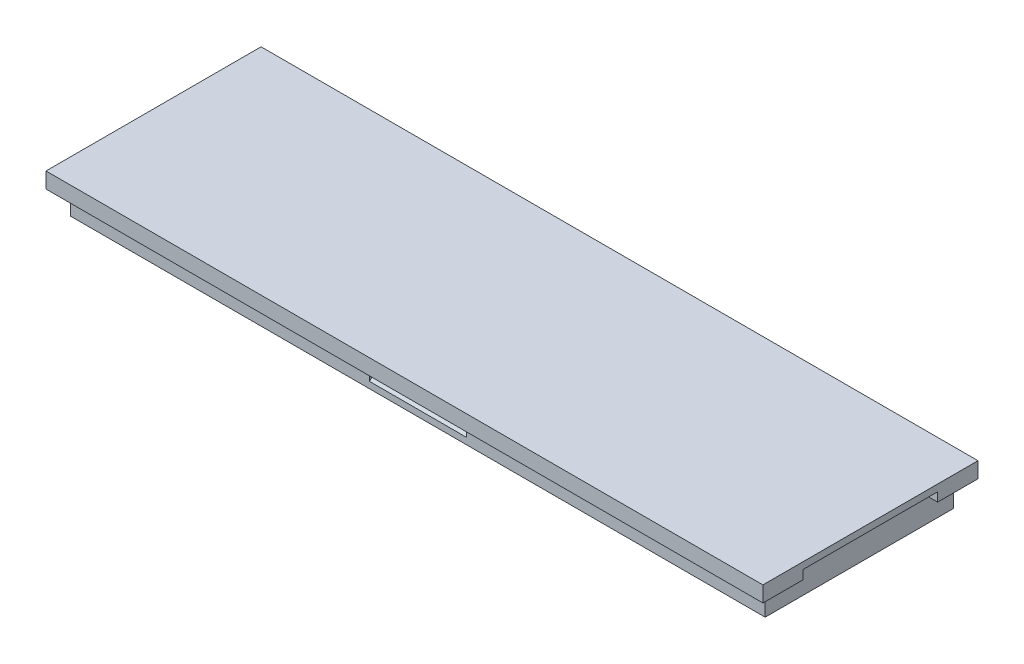
ISO-10303-21;
HEADER;
FILE_DESCRIPTION(('STEP AP214'),'2;1');
FILE_NAME('part.step','',(''),(''),'','','');
FILE_SCHEMA(('AUTOMOTIVE_DESIGN { 1 0 10303 214 1 1 1 1 }'));
ENDSEC;
DATA;
#1=APPLICATION_CONTEXT('core data for automotive mechanical design processes');
#2=APPLICATION_PROTOCOL_DEFINITION('international standard','automotive_design',2000,#1);
#3=PRODUCT_CONTEXT('',#1,'mechanical');
#4=PRODUCT('Part','Part','',(#3));
#5=PRODUCT_RELATED_PRODUCT_CATEGORY('part','',(#4));
#6=PRODUCT_DEFINITION_FORMATION('','',#4);
#7=PRODUCT_DEFINITION_CONTEXT('part definition',#1,'design');
#8=PRODUCT_DEFINITION('design','',#6,#7);
#9=PRODUCT_DEFINITION_SHAPE('','',#8);
#10=(LENGTH_UNIT() NAMED_UNIT(*) SI_UNIT(.MILLI.,.METRE.));
#11=(NAMED_UNIT(*) PLANE_ANGLE_UNIT() SI_UNIT($,.RADIAN.));
#12=(NAMED_UNIT(*) SI_UNIT($,.STERADIAN.) SOLID_ANGLE_UNIT());
#13=UNCERTAINTY_MEASURE_WITH_UNIT(LENGTH_MEASURE(1.E-05),#10,'distance_accuracy_value','');
#14=(GEOMETRIC_REPRESENTATION_CONTEXT(3) GLOBAL_UNCERTAINTY_ASSIGNED_CONTEXT((#13)) GLOBAL_UNIT_ASSIGNED_CONTEXT((#10,
#11,#12)) REPRESENTATION_CONTEXT('',''));
#15=CARTESIAN_POINT('',(0.,0.,0.));
#16=DIRECTION('',(0.,0.,1.));
#17=DIRECTION('',(1.,0.,0.));
#18=AXIS2_PLACEMENT_3D('',#15,#16,#17);
#19=CARTESIAN_POINT('',(40.,-4.17634676841416E-13,-12.));
#20=DIRECTION('',(-1.,0.,0.));
#21=DIRECTION('',(0.,-1.,0.));
#22=AXIS2_PLACEMENT_3D('',#19,#20,#21);
#23=PLANE('',#22);
#24=DIRECTION('',(0.,-1.,0.));
#25=VECTOR('',#24,1.);
#26=CARTESIAN_POINT('',(40.,-0.74999999999958,-7.5));
#27=LINE('',#26,#25);
#28=CARTESIAN_POINT('',(40.,-0.74999999999958,-7.5));
#29=VERTEX_POINT('',#28);
#30=CARTESIAN_POINT('',(40.,-1.74999999999958,-7.5));
#31=VERTEX_POINT('',#30);
#32=EDGE_CURVE('E586',#29,#31,#27,.T.);
#33=ORIENTED_EDGE('',*,*,#32,.T.);
#34=DIRECTION('',(0.,0.,-1.));
#35=VECTOR('',#34,1.);
#36=CARTESIAN_POINT('',(40.,-1.75000000000042,-12.));
#37=LINE('',#36,#35);
#38=CARTESIAN_POINT('',(40.,-1.75000000000042,-12.));
#39=VERTEX_POINT('',#38);
#40=EDGE_CURVE('E206',#31,#39,#37,.T.);
#41=ORIENTED_EDGE('',*,*,#40,.T.);
#42=DIRECTION('',(0.,-1.,0.));
#43=VECTOR('',#42,1.);
#44=CARTESIAN_POINT('',(40.,-4.17634676841416E-13,-12.));
#45=LINE('',#44,#43);
#46=CARTESIAN_POINT('',(40.,-4.17634676841416E-13,-12.));
#47=VERTEX_POINT('',#46);
#48=EDGE_CURVE('E218',#47,#39,#45,.T.);
#49=ORIENTED_EDGE('',*,*,#48,.F.);
#50=DIRECTION('',(0.,0.,-1.));
#51=VECTOR('',#50,1.);
#52=CARTESIAN_POINT('',(40.,-4.17634676841416E-13,-12.));
#53=LINE('',#52,#51);
#54=CARTESIAN_POINT('',(40.,-4.17634676841416E-13,12.));
#55=VERTEX_POINT('',#54);
#56=EDGE_CURVE('E193',#55,#47,#53,.T.);
#57=ORIENTED_EDGE('',*,*,#56,.F.);
#58=DIRECTION('',(0.,-1.,0.));
#59=VECTOR('',#58,1.);
#60=CARTESIAN_POINT('',(40.,-4.17634676841416E-13,12.));
#61=LINE('',#60,#59);
#62=CARTESIAN_POINT('',(40.,-1.75000000000042,12.));
#63=VERTEX_POINT('',#62);
#64=EDGE_CURVE('E203',#55,#63,#61,.T.);
#65=ORIENTED_EDGE('',*,*,#64,.T.);
#66=CARTESIAN_POINT('',(40.,-1.75000000000042,7.5));
#67=VERTEX_POINT('',#66);
#68=EDGE_CURVE('E186',#63,#67,#37,.T.);
#69=ORIENTED_EDGE('',*,*,#68,.T.);
#70=DIRECTION('',(0.,-1.,0.));
#71=VECTOR('',#70,1.);
#72=CARTESIAN_POINT('',(40.,-0.74999999999958,7.5));
#73=LINE('',#72,#71);
#74=CARTESIAN_POINT('',(40.,-0.74999999999958,7.5));
#75=VERTEX_POINT('',#74);
#76=EDGE_CURVE('E56',#75,#67,#73,.T.);
#77=ORIENTED_EDGE('',*,*,#76,.F.);
#78=DIRECTION('',(0.,0.,-1.));
#79=VECTOR('',#78,1.);
#80=CARTESIAN_POINT('',(40.,-0.74999999999958,7.5));
#81=LINE('',#80,#79);
#82=EDGE_CURVE('E173',#75,#29,#81,.T.);
#83=ORIENTED_EDGE('',*,*,#82,.T.);
#84=EDGE_LOOP('',(#33,#41,#49,#57,#65,#69,#77,#83));
#85=FACE_BOUND('',#84,.T.);
#86=ADVANCED_FACE('F41',(#85),#23,.F.);
#87=CARTESIAN_POINT('',(0.,-1.75,0.));
#88=DIRECTION('',(0.,1.,0.));
#89=DIRECTION('',(-1.,0.,0.));
#90=AXIS2_PLACEMENT_3D('',#87,#88,#89);
#91=PLANE('',#90);
#92=DIRECTION('',(1.,0.,0.));
#93=VECTOR('',#92,1.);
#94=CARTESIAN_POINT('',(40.,-1.74999999999958,7.5));
#95=LINE('',#94,#93);
#96=CARTESIAN_POINT('',(38.75,-1.74999999999959,7.5));
#97=VERTEX_POINT('',#96);
#98=EDGE_CURVE('E580',#97,#67,#95,.T.);
#99=ORIENTED_EDGE('',*,*,#98,.T.);
#100=ORIENTED_EDGE('',*,*,#68,.F.);
#101=DIRECTION('',(1.,0.,0.));
#102=VECTOR('',#101,1.);
#103=CARTESIAN_POINT('',(-40.,-1.74999999999958,12.));
#104=LINE('',#103,#102);
#105=CARTESIAN_POINT('',(-40.,-1.74999999999958,12.));
#106=VERTEX_POINT('',#105);
#107=EDGE_CURVE('E197',#106,#63,#104,.T.);
#108=ORIENTED_EDGE('',*,*,#107,.F.);
#109=DIRECTION('',(0.,0.,1.));
#110=VECTOR('',#109,1.);
#111=CARTESIAN_POINT('',(-40.,-1.74999999999958,-12.));
#112=LINE('',#111,#110);
#113=CARTESIAN_POINT('',(-40.,-1.74999999999958,-12.));
#114=VERTEX_POINT('',#113);
#115=EDGE_CURVE('E208',#114,#106,#112,.T.);
#116=ORIENTED_EDGE('',*,*,#115,.F.);
#117=DIRECTION('',(-1.,0.,0.));
#118=VECTOR('',#117,1.);
#119=CARTESIAN_POINT('',(-40.,-1.74999999999958,-12.));
#120=LINE('',#119,#118);
#121=EDGE_CURVE('E205',#39,#114,#120,.T.);
#122=ORIENTED_EDGE('',*,*,#121,.F.);
#123=ORIENTED_EDGE('',*,*,#40,.F.);
#124=DIRECTION('',(-1.,0.,0.));
#125=VECTOR('',#124,1.);
#126=CARTESIAN_POINT('',(40.,-1.74999999999958,-7.5));
#127=LINE('',#126,#125);
#128=CARTESIAN_POINT('',(38.75,-1.74999999999959,-7.5));
#129=VERTEX_POINT('',#128);
#130=EDGE_CURVE('E181',#31,#129,#127,.T.);
#131=ORIENTED_EDGE('',*,*,#130,.T.);
#132=DIRECTION('',(0.,0.,1.));
#133=VECTOR('',#132,1.);
#134=CARTESIAN_POINT('',(38.7500000000001,-1.75,10.5));
#135=LINE('',#134,#133);
#136=CARTESIAN_POINT('',(38.7500000000001,-1.75,-10.5));
#137=VERTEX_POINT('',#136);
#138=EDGE_CURVE('E257',#137,#129,#135,.T.);
#139=ORIENTED_EDGE('',*,*,#138,.F.);
#140=DIRECTION('',(1.,0.,0.));
#141=VECTOR('',#140,1.);
#142=CARTESIAN_POINT('',(-38.75,-1.75,-10.5));
#143=LINE('',#142,#141);
#144=CARTESIAN_POINT('',(-38.75,-1.74999999999959,-10.5));
#145=VERTEX_POINT('',#144);
#146=EDGE_CURVE('E250',#145,#137,#143,.T.);
#147=ORIENTED_EDGE('',*,*,#146,.F.);
#148=DIRECTION('',(0.,0.,-1.));
#149=VECTOR('',#148,1.);
#150=CARTESIAN_POINT('',(-38.75,-1.75,10.5));
#151=LINE('',#150,#149);
#152=CARTESIAN_POINT('',(-38.75,-1.74999999999959,10.5));
#153=VERTEX_POINT('',#152);
#154=EDGE_CURVE('E263',#153,#145,#151,.T.);
#155=ORIENTED_EDGE('',*,*,#154,.F.);
#156=DIRECTION('',(-1.,0.,0.));
#157=VECTOR('',#156,1.);
#158=CARTESIAN_POINT('',(-38.75,-1.75,10.5));
#159=LINE('',#158,#157);
#160=CARTESIAN_POINT('',(38.7500000000001,-1.7500000000004,10.5));
#161=VERTEX_POINT('',#160);
#162=EDGE_CURVE('E260',#161,#153,#159,.T.);
#163=ORIENTED_EDGE('',*,*,#162,.F.);
#164=EDGE_CURVE('E245',#97,#161,#135,.T.);
#165=ORIENTED_EDGE('',*,*,#164,.F.);
#166=EDGE_LOOP('',(#99,#100,#108,#116,#122,#123,#131,#139,#147,#155,#163,#165));
#167=FACE_BOUND('',#166,.T.);
#168=ADVANCED_FACE('F319',(#167),#91,.F.);
#169=CARTESIAN_POINT('',(38.7500000000001,-4.5,10.5));
#170=DIRECTION('',(-1.,0.,0.));
#171=DIRECTION('',(0.,0.,1.));
#172=AXIS2_PLACEMENT_3D('',#169,#170,#171);
#173=PLANE('',#172);
#174=ORIENTED_EDGE('',*,*,#138,.T.);
#175=DIRECTION('',(0.,-1.,0.));
#176=VECTOR('',#175,1.);
#177=CARTESIAN_POINT('',(38.7499999999999,-0.749999999999593,-7.5));
#178=LINE('',#177,#176);
#179=CARTESIAN_POINT('',(38.7499999999999,-0.749999999999593,-7.5));
#180=VERTEX_POINT('',#179);
#181=EDGE_CURVE('E188',#180,#129,#178,.T.);
#182=ORIENTED_EDGE('',*,*,#181,.F.);
#183=DIRECTION('',(0.,0.,1.));
#184=VECTOR('',#183,1.);
#185=CARTESIAN_POINT('',(38.7499999999999,-0.749999999999593,7.5));
#186=LINE('',#185,#184);
#187=CARTESIAN_POINT('',(38.7499999999999,-0.749999999999593,7.5));
#188=VERTEX_POINT('',#187);
#189=EDGE_CURVE('E172',#180,#188,#186,.T.);
#190=ORIENTED_EDGE('',*,*,#189,.T.);
#191=DIRECTION('',(0.,-1.,0.));
#192=VECTOR('',#191,1.);
#193=CARTESIAN_POINT('',(38.7499999999999,-0.749999999999593,7.5));
#194=LINE('',#193,#192);
#195=EDGE_CURVE('E169',#188,#97,#194,.T.);
#196=ORIENTED_EDGE('',*,*,#195,.T.);
#197=ORIENTED_EDGE('',*,*,#164,.T.);
#198=DIRECTION('',(0.,1.,0.));
#199=VECTOR('',#198,1.);
#200=CARTESIAN_POINT('',(38.7500000000001,-4.5,10.5));
#201=LINE('',#200,#199);
#202=CARTESIAN_POINT('',(38.7500000000001,-4.5,10.5));
#203=VERTEX_POINT('',#202);
#204=EDGE_CURVE('E275',#203,#161,#201,.T.);
#205=ORIENTED_EDGE('',*,*,#204,.F.);
#206=DIRECTION('',(0.,0.,1.));
#207=VECTOR('',#206,1.);
#208=CARTESIAN_POINT('',(38.7500000000001,-4.5,10.5));
#209=LINE('',#208,#207);
#210=CARTESIAN_POINT('',(38.7500000000001,-4.5,-10.5));
#211=VERTEX_POINT('',#210);
#212=EDGE_CURVE('E246',#211,#203,#209,.T.);
#213=ORIENTED_EDGE('',*,*,#212,.F.);
#214=DIRECTION('',(0.,1.,0.));
#215=VECTOR('',#214,1.);
#216=CARTESIAN_POINT('',(38.7500000000001,-4.5,-10.5));
#217=LINE('',#216,#215);
#218=EDGE_CURVE('E256',#211,#137,#217,.T.);
#219=ORIENTED_EDGE('',*,*,#218,.T.);
#220=EDGE_LOOP('',(#174,#182,#190,#196,#197,#205,#213,#219));
#221=FACE_BOUND('',#220,.T.);
#222=ADVANCED_FACE('F43',(#221),#173,.F.);
#223=CARTESIAN_POINT('',(-38.75,-4.5,10.5));
#224=DIRECTION('',(0.,0.,-1.));
#225=DIRECTION('',(-1.,0.,0.));
#226=AXIS2_PLACEMENT_3D('',#223,#224,#225);
#227=PLANE('',#226);
#228=DIRECTION('',(1.,0.,0.));
#229=VECTOR('',#228,1.);
#230=CARTESIAN_POINT('',(-38.7499999999999,-1.93431457505033,10.5));
#231=LINE('',#230,#229);
#232=CARTESIAN_POINT('',(-5.40000000000005,-1.93431457505067,10.5));
#233=VERTEX_POINT('',#232);
#234=CARTESIAN_POINT('',(5.39999999999995,-1.93431457505079,10.5));
#235=VERTEX_POINT('',#234);
#236=EDGE_CURVE('E283',#233,#235,#231,.T.);
#237=ORIENTED_EDGE('',*,*,#236,.T.);
#238=DIRECTION('',(0.,-1.,0.));
#239=VECTOR('',#238,1.);
#240=CARTESIAN_POINT('',(5.39999999999992,-4.50000000000046,10.5));
#241=LINE('',#240,#239);
#242=CARTESIAN_POINT('',(5.39999999999993,-3.78288309677796,10.5));
#243=VERTEX_POINT('',#242);
#244=EDGE_CURVE('E286',#235,#243,#241,.T.);
#245=ORIENTED_EDGE('',*,*,#244,.T.);
#246=DIRECTION('',(-1.,0.,0.));
#247=VECTOR('',#246,1.);
#248=CARTESIAN_POINT('',(-38.7499999999999,-3.78288309677749,10.5));
#249=LINE('',#248,#247);
#250=CARTESIAN_POINT('',(-5.40000000000007,-3.78288309677784,10.5));
#251=VERTEX_POINT('',#250);
#252=EDGE_CURVE('E280',#243,#251,#249,.T.);
#253=ORIENTED_EDGE('',*,*,#252,.T.);
#254=DIRECTION('',(0.,-1.,0.));
#255=VECTOR('',#254,1.);
#256=CARTESIAN_POINT('',(-5.40000000000008,-4.50000000000035,10.5));
#257=LINE('',#256,#255);
#258=EDGE_CURVE('E278',#233,#251,#257,.T.);
#259=ORIENTED_EDGE('',*,*,#258,.F.);
#260=EDGE_LOOP('',(#237,#245,#253,#259));
#261=FACE_BOUND('',#260,.T.);
#262=ORIENTED_EDGE('',*,*,#162,.T.);
#263=DIRECTION('',(0.,1.,0.));
#264=VECTOR('',#263,1.);
#265=CARTESIAN_POINT('',(-38.75,-4.5,10.5));
#266=LINE('',#265,#264);
#267=CARTESIAN_POINT('',(-38.75,-4.5,10.5));
#268=VERTEX_POINT('',#267);
#269=EDGE_CURVE('E272',#268,#153,#266,.T.);
#270=ORIENTED_EDGE('',*,*,#269,.F.);
#271=DIRECTION('',(-1.,0.,0.));
#272=VECTOR('',#271,1.);
#273=CARTESIAN_POINT('',(-38.75,-4.5,10.5));
#274=LINE('',#273,#272);
#275=EDGE_CURVE('E249',#203,#268,#274,.T.);
#276=ORIENTED_EDGE('',*,*,#275,.F.);
#277=ORIENTED_EDGE('',*,*,#204,.T.);
#278=EDGE_LOOP('',(#262,#270,#276,#277));
#279=FACE_BOUND('',#278,.T.);
#280=ADVANCED_FACE('F389',(#261,#279),#227,.F.);
#281=CARTESIAN_POINT('',(-38.75,-4.5,10.5));
#282=DIRECTION('',(1.,0.,0.));
#283=DIRECTION('',(0.,0.,-1.));
#284=AXIS2_PLACEMENT_3D('',#281,#282,#283);
#285=PLANE('',#284);
#286=ORIENTED_EDGE('',*,*,#154,.T.);
#287=DIRECTION('',(0.,1.,0.));
#288=VECTOR('',#287,1.);
#289=CARTESIAN_POINT('',(-38.75,-4.5,-10.5));
#290=LINE('',#289,#288);
#291=CARTESIAN_POINT('',(-38.75,-4.5,-10.5));
#292=VERTEX_POINT('',#291);
#293=EDGE_CURVE('E269',#292,#145,#290,.T.);
#294=ORIENTED_EDGE('',*,*,#293,.F.);
#295=DIRECTION('',(0.,0.,-1.));
#296=VECTOR('',#295,1.);
#297=CARTESIAN_POINT('',(-38.75,-4.5,10.5));
#298=LINE('',#297,#296);
#299=EDGE_CURVE('E252',#268,#292,#298,.T.);
#300=ORIENTED_EDGE('',*,*,#299,.F.);
#301=ORIENTED_EDGE('',*,*,#269,.T.);
#302=EDGE_LOOP('',(#286,#294,#300,#301));
#303=FACE_BOUND('',#302,.T.);
#304=ADVANCED_FACE('F427',(#303),#285,.F.);
#305=CARTESIAN_POINT('',(-38.75,-4.5,-10.5));
#306=DIRECTION('',(0.,0.,1.));
#307=DIRECTION('',(1.,0.,0.));
#308=AXIS2_PLACEMENT_3D('',#305,#306,#307);
#309=PLANE('',#308);
#310=DIRECTION('',(-1.,0.,0.));
#311=VECTOR('',#310,1.);
#312=CARTESIAN_POINT('',(-38.7499999999999,-3.78288309677743,-10.5));
#313=LINE('',#312,#311);
#314=CARTESIAN_POINT('',(5.39999999999993,-3.78288309677788,-10.5));
#315=VERTEX_POINT('',#314);
#316=CARTESIAN_POINT('',(-5.40000000000007,-3.78288309677777,-10.5));
#317=VERTEX_POINT('',#316);
#318=EDGE_CURVE('E291',#315,#317,#313,.T.);
#319=ORIENTED_EDGE('',*,*,#318,.F.);
#320=DIRECTION('',(0.,1.,0.));
#321=VECTOR('',#320,1.);
#322=CARTESIAN_POINT('',(5.39999999999992,-4.50000000000046,-10.5));
#323=LINE('',#322,#321);
#324=CARTESIAN_POINT('',(5.39999999999995,-1.93431457505086,-10.5));
#325=VERTEX_POINT('',#324);
#326=EDGE_CURVE('E11',#315,#325,#323,.T.);
#327=ORIENTED_EDGE('',*,*,#326,.T.);
#328=DIRECTION('',(1.,0.,0.));
#329=VECTOR('',#328,1.);
#330=CARTESIAN_POINT('',(-38.7499999999999,-1.9343145750504,-10.5));
#331=LINE('',#330,#329);
#332=CARTESIAN_POINT('',(-5.40000000000005,-1.93431457505075,-10.5));
#333=VERTEX_POINT('',#332);
#334=EDGE_CURVE('E49',#333,#325,#331,.T.);
#335=ORIENTED_EDGE('',*,*,#334,.F.);
#336=DIRECTION('',(0.,1.,0.));
#337=VECTOR('',#336,1.);
#338=CARTESIAN_POINT('',(-5.40000000000008,-4.50000000000035,-10.5));
#339=LINE('',#338,#337);
#340=EDGE_CURVE('E289',#317,#333,#339,.T.);
#341=ORIENTED_EDGE('',*,*,#340,.F.);
#342=EDGE_LOOP('',(#319,#327,#335,#341));
#343=FACE_BOUND('',#342,.T.);
#344=ORIENTED_EDGE('',*,*,#146,.T.);
#345=ORIENTED_EDGE('',*,*,#218,.F.);
#346=DIRECTION('',(1.,0.,0.));
#347=VECTOR('',#346,1.);
#348=CARTESIAN_POINT('',(-38.75,-4.5,-10.5));
#349=LINE('',#348,#347);
#350=EDGE_CURVE('E254',#292,#211,#349,.T.);
#351=ORIENTED_EDGE('',*,*,#350,.F.);
#352=ORIENTED_EDGE('',*,*,#293,.T.);
#353=EDGE_LOOP('',(#344,#345,#351,#352));
#354=FACE_BOUND('',#353,.T.);
#355=ADVANCED_FACE('F304',(#343,#354),#309,.F.);
#356=CARTESIAN_POINT('',(0.,-4.5,0.));
#357=DIRECTION('',(0.,-1.,0.));
#358=DIRECTION('',(0.,0.,-1.));
#359=AXIS2_PLACEMENT_3D('',#356,#357,#358);
#360=PLANE('',#359);
#361=ORIENTED_EDGE('',*,*,#212,.T.);
#362=ORIENTED_EDGE('',*,*,#275,.T.);
#363=ORIENTED_EDGE('',*,*,#299,.T.);
#364=ORIENTED_EDGE('',*,*,#350,.T.);
#365=EDGE_LOOP('',(#361,#362,#363,#364));
#366=FACE_BOUND('',#365,.T.);
#367=ADVANCED_FACE('F426',(#366),#360,.T.);
#368=CARTESIAN_POINT('',(5.3999999999999,-6.21715728752544,6.21715728752539));
#369=DIRECTION('',(0.,0.707106781186547,-0.707106781186548));
#370=DIRECTION('',(0.,0.707106781186548,0.707106781186547));
#371=AXIS2_PLACEMENT_3D('',#368,#369,#370);
#372=PLANE('',#371);
#373=DIRECTION('',(0.,-0.707106781186548,-0.707106781186547));
#374=VECTOR('',#373,1.);
#375=CARTESIAN_POINT('',(-5.4000000000001,-6.21715728752533,6.21715728752539));
#376=LINE('',#375,#374);
#377=CARTESIAN_POINT('',(-5.40000000000006,-2.85846689479549,9.57584768025522));
#378=VERTEX_POINT('',#377);
#379=EDGE_CURVE('E232',#233,#378,#376,.T.);
#380=ORIENTED_EDGE('',*,*,#379,.T.);
#381=DIRECTION('',(-1.,0.,0.));
#382=VECTOR('',#381,1.);
#383=CARTESIAN_POINT('',(5.39999999999994,-2.85846689479561,9.57584768025522));
#384=LINE('',#383,#382);
#385=CARTESIAN_POINT('',(5.39999999999994,-2.85846689479561,9.57584768025522));
#386=VERTEX_POINT('',#385);
#387=EDGE_CURVE('E242',#386,#378,#384,.T.);
#388=ORIENTED_EDGE('',*,*,#387,.F.);
#389=DIRECTION('',(0.,-0.707106781186548,-0.707106781186547));
#390=VECTOR('',#389,1.);
#391=CARTESIAN_POINT('',(5.3999999999999,-6.21715728752544,6.21715728752539));
#392=LINE('',#391,#390);
#393=EDGE_CURVE('E237',#235,#386,#392,.T.);
#394=ORIENTED_EDGE('',*,*,#393,.F.);
#395=ORIENTED_EDGE('',*,*,#236,.F.);
#396=EDGE_LOOP('',(#380,#388,#394,#395));
#397=FACE_BOUND('',#396,.T.);
#398=ADVANCED_FACE('F494',(#397),#372,.F.);
#399=CARTESIAN_POINT('',(5.4,3.35909824231865,3.36005739844627));
#400=DIRECTION('',(0.,-0.707005834841565,-0.707207713122518));
#401=DIRECTION('',(0.,0.707207713122518,-0.707005834841565));
#402=AXIS2_PLACEMENT_3D('',#399,#400,#401);
#403=PLANE('',#402);
#404=DIRECTION('',(0.,-0.707207713122518,0.707005834841565));
#405=VECTOR('',#404,1.);
#406=CARTESIAN_POINT('',(5.4,3.35909824231865,3.36005739844627));
#407=LINE('',#406,#405);
#408=EDGE_CURVE('E239',#386,#243,#407,.T.);
#409=ORIENTED_EDGE('',*,*,#408,.F.);
#410=ORIENTED_EDGE('',*,*,#387,.T.);
#411=DIRECTION('',(0.,-0.707207713122518,0.707005834841565));
#412=VECTOR('',#411,1.);
#413=CARTESIAN_POINT('',(-5.4,3.35909824231876,3.36005739844627));
#414=LINE('',#413,#412);
#415=EDGE_CURVE('E234',#378,#251,#414,.T.);
#416=ORIENTED_EDGE('',*,*,#415,.T.);
#417=ORIENTED_EDGE('',*,*,#252,.F.);
#418=EDGE_LOOP('',(#409,#410,#416,#417));
#419=FACE_BOUND('',#418,.T.);
#420=ADVANCED_FACE('F483',(#419),#403,.F.);
#421=CARTESIAN_POINT('',(5.39999999999997,0.,0.));
#422=DIRECTION('',(1.,0.,0.));
#423=DIRECTION('',(0.,1.,0.));
#424=AXIS2_PLACEMENT_3D('',#421,#422,#423);
#425=PLANE('',#424);
#426=ORIENTED_EDGE('',*,*,#393,.T.);
#427=ORIENTED_EDGE('',*,*,#408,.T.);
#428=ORIENTED_EDGE('',*,*,#244,.F.);
#429=EDGE_LOOP('',(#426,#427,#428));
#430=FACE_BOUND('',#429,.T.);
#431=ADVANCED_FACE('F472',(#430),#425,.F.);
#432=CARTESIAN_POINT('',(-5.40000000000003,0.,0.));
#433=DIRECTION('',(1.,0.,0.));
#434=DIRECTION('',(0.,1.,0.));
#435=AXIS2_PLACEMENT_3D('',#432,#433,#434);
#436=PLANE('',#435);
#437=ORIENTED_EDGE('',*,*,#258,.T.);
#438=ORIENTED_EDGE('',*,*,#415,.F.);
#439=ORIENTED_EDGE('',*,*,#379,.F.);
#440=EDGE_LOOP('',(#437,#438,#439));
#441=FACE_BOUND('',#440,.T.);
#442=ADVANCED_FACE('F316',(#441),#436,.T.);
#443=CARTESIAN_POINT('',(5.3999999999999,-6.21715728752544,-6.21715728752539));
#444=DIRECTION('',(0.,-0.707106781186547,-0.707106781186548));
#445=DIRECTION('',(0.,0.707106781186548,-0.707106781186547));
#446=AXIS2_PLACEMENT_3D('',#443,#444,#445);
#447=PLANE('',#446);
#448=ORIENTED_EDGE('',*,*,#334,.T.);
#449=DIRECTION('',(0.,-0.707106781186548,0.707106781186547));
#450=VECTOR('',#449,1.);
#451=CARTESIAN_POINT('',(5.3999999999999,-6.21715728752544,-6.21715728752539));
#452=LINE('',#451,#450);
#453=CARTESIAN_POINT('',(5.39999999999994,-2.85846689479561,-9.57584768025522));
#454=VERTEX_POINT('',#453);
#455=EDGE_CURVE('E224',#325,#454,#452,.T.);
#456=ORIENTED_EDGE('',*,*,#455,.T.);
#457=DIRECTION('',(-1.,0.,0.));
#458=VECTOR('',#457,1.);
#459=CARTESIAN_POINT('',(5.39999999999994,-2.85846689479561,-9.57584768025522));
#460=LINE('',#459,#458);
#461=CARTESIAN_POINT('',(-5.40000000000006,-2.85846689479549,-9.57584768025522));
#462=VERTEX_POINT('',#461);
#463=EDGE_CURVE('E229',#454,#462,#460,.T.);
#464=ORIENTED_EDGE('',*,*,#463,.T.);
#465=DIRECTION('',(0.,-0.707106781186548,0.707106781186547));
#466=VECTOR('',#465,1.);
#467=CARTESIAN_POINT('',(-5.4000000000001,-6.21715728752533,-6.21715728752539));
#468=LINE('',#467,#466);
#469=EDGE_CURVE('E221',#333,#462,#468,.T.);
#470=ORIENTED_EDGE('',*,*,#469,.F.);
#471=EDGE_LOOP('',(#448,#456,#464,#470));
#472=FACE_BOUND('',#471,.T.);
#473=ADVANCED_FACE('F296',(#472),#447,.T.);
#474=CARTESIAN_POINT('',(5.4,3.35909824231865,-3.36005739844627));
#475=DIRECTION('',(0.,0.707005834841565,-0.707207713122518));
#476=DIRECTION('',(0.,0.707207713122518,0.707005834841565));
#477=AXIS2_PLACEMENT_3D('',#474,#475,#476);
#478=PLANE('',#477);
#479=ORIENTED_EDGE('',*,*,#318,.T.);
#480=DIRECTION('',(0.,-0.707207713122518,-0.707005834841565));
#481=VECTOR('',#480,1.);
#482=CARTESIAN_POINT('',(-5.4,3.35909824231876,-3.36005739844627));
#483=LINE('',#482,#481);
#484=EDGE_CURVE('E64',#462,#317,#483,.T.);
#485=ORIENTED_EDGE('',*,*,#484,.F.);
#486=ORIENTED_EDGE('',*,*,#463,.F.);
#487=DIRECTION('',(0.,-0.707207713122518,-0.707005834841565));
#488=VECTOR('',#487,1.);
#489=CARTESIAN_POINT('',(5.4,3.35909824231865,-3.36005739844627));
#490=LINE('',#489,#488);
#491=EDGE_CURVE('E226',#454,#315,#490,.T.);
#492=ORIENTED_EDGE('',*,*,#491,.T.);
#493=EDGE_LOOP('',(#479,#485,#486,#492));
#494=FACE_BOUND('',#493,.T.);
#495=ADVANCED_FACE('F307',(#494),#478,.T.);
#496=CARTESIAN_POINT('',(5.39999999999997,0.,0.));
#497=DIRECTION('',(1.,0.,0.));
#498=DIRECTION('',(0.,1.,0.));
#499=AXIS2_PLACEMENT_3D('',#496,#497,#498);
#500=PLANE('',#499);
#501=ORIENTED_EDGE('',*,*,#491,.F.);
#502=ORIENTED_EDGE('',*,*,#455,.F.);
#503=ORIENTED_EDGE('',*,*,#326,.F.);
#504=EDGE_LOOP('',(#501,#502,#503));
#505=FACE_BOUND('',#504,.T.);
#506=ADVANCED_FACE('F301',(#505),#500,.F.);
#507=CARTESIAN_POINT('',(-5.40000000000003,0.,0.));
#508=DIRECTION('',(1.,0.,0.));
#509=DIRECTION('',(0.,1.,0.));
#510=AXIS2_PLACEMENT_3D('',#507,#508,#509);
#511=PLANE('',#510);
#512=ORIENTED_EDGE('',*,*,#340,.T.);
#513=ORIENTED_EDGE('',*,*,#469,.T.);
#514=ORIENTED_EDGE('',*,*,#484,.T.);
#515=EDGE_LOOP('',(#512,#513,#514));
#516=FACE_BOUND('',#515,.T.);
#517=ADVANCED_FACE('F314',(#516),#511,.T.);
#518=CARTESIAN_POINT('',(-40.,4.20236762055382E-13,-12.));
#519=DIRECTION('',(0.,0.,1.));
#520=DIRECTION('',(1.,0.,0.));
#521=AXIS2_PLACEMENT_3D('',#518,#519,#520);
#522=PLANE('',#521);
#523=ORIENTED_EDGE('',*,*,#121,.T.);
#524=DIRECTION('',(0.,-1.,0.));
#525=VECTOR('',#524,1.);
#526=CARTESIAN_POINT('',(-40.,4.20236762055382E-13,-12.));
#527=LINE('',#526,#525);
#528=CARTESIAN_POINT('',(-40.,4.20236762055382E-13,-12.));
#529=VERTEX_POINT('',#528);
#530=EDGE_CURVE('E215',#529,#114,#527,.T.);
#531=ORIENTED_EDGE('',*,*,#530,.F.);
#532=DIRECTION('',(-1.,0.,0.));
#533=VECTOR('',#532,1.);
#534=CARTESIAN_POINT('',(-40.,4.20236762055382E-13,-12.));
#535=LINE('',#534,#533);
#536=EDGE_CURVE('E196',#47,#529,#535,.T.);
#537=ORIENTED_EDGE('',*,*,#536,.F.);
#538=ORIENTED_EDGE('',*,*,#48,.T.);
#539=EDGE_LOOP('',(#523,#531,#537,#538));
#540=FACE_BOUND('',#539,.T.);
#541=ADVANCED_FACE('F328',(#540),#522,.F.);
#542=CARTESIAN_POINT('',(-40.,4.20236762055382E-13,-12.));
#543=DIRECTION('',(1.,0.,0.));
#544=DIRECTION('',(0.,1.,0.));
#545=AXIS2_PLACEMENT_3D('',#542,#543,#544);
#546=PLANE('',#545);
#547=ORIENTED_EDGE('',*,*,#115,.T.);
#548=DIRECTION('',(0.,-1.,0.));
#549=VECTOR('',#548,1.);
#550=CARTESIAN_POINT('',(-40.,4.20236762055382E-13,12.));
#551=LINE('',#550,#549);
#552=CARTESIAN_POINT('',(-40.,4.20236762055382E-13,12.));
#553=VERTEX_POINT('',#552);
#554=EDGE_CURVE('E212',#553,#106,#551,.T.);
#555=ORIENTED_EDGE('',*,*,#554,.F.);
#556=DIRECTION('',(0.,0.,1.));
#557=VECTOR('',#556,1.);
#558=CARTESIAN_POINT('',(-40.,4.20236762055382E-13,-12.));
#559=LINE('',#558,#557);
#560=EDGE_CURVE('E199',#529,#553,#559,.T.);
#561=ORIENTED_EDGE('',*,*,#560,.F.);
#562=ORIENTED_EDGE('',*,*,#530,.T.);
#563=EDGE_LOOP('',(#547,#555,#561,#562));
#564=FACE_BOUND('',#563,.T.);
#565=ADVANCED_FACE('F334',(#564),#546,.F.);
#566=CARTESIAN_POINT('',(-40.,4.20236762055382E-13,12.));
#567=DIRECTION('',(0.,0.,-1.));
#568=DIRECTION('',(-1.,0.,0.));
#569=AXIS2_PLACEMENT_3D('',#566,#567,#568);
#570=PLANE('',#569);
#571=ORIENTED_EDGE('',*,*,#107,.T.);
#572=ORIENTED_EDGE('',*,*,#64,.F.);
#573=DIRECTION('',(1.,0.,0.));
#574=VECTOR('',#573,1.);
#575=CARTESIAN_POINT('',(-40.,4.20236762055382E-13,12.));
#576=LINE('',#575,#574);
#577=EDGE_CURVE('E201',#553,#55,#576,.T.);
#578=ORIENTED_EDGE('',*,*,#577,.F.);
#579=ORIENTED_EDGE('',*,*,#554,.T.);
#580=EDGE_LOOP('',(#571,#572,#578,#579));
#581=FACE_BOUND('',#580,.T.);
#582=ADVANCED_FACE('F339',(#581),#570,.F.);
#583=CARTESIAN_POINT('',(0.,0.,0.));
#584=DIRECTION('',(0.,1.,0.));
#585=DIRECTION('',(-1.,0.,0.));
#586=AXIS2_PLACEMENT_3D('',#583,#584,#585);
#587=PLANE('',#586);
#588=ORIENTED_EDGE('',*,*,#56,.T.);
#589=ORIENTED_EDGE('',*,*,#536,.T.);
#590=ORIENTED_EDGE('',*,*,#560,.T.);
#591=ORIENTED_EDGE('',*,*,#577,.T.);
#592=EDGE_LOOP('',(#588,#589,#590,#591));
#593=FACE_BOUND('',#592,.T.);
#594=ADVANCED_FACE('F354',(#593),#587,.T.);
#595=CARTESIAN_POINT('',(40.,-0.74999999999958,-7.5));
#596=DIRECTION('',(0.,0.,1.));
#597=DIRECTION('',(1.,0.,0.));
#598=AXIS2_PLACEMENT_3D('',#595,#596,#597);
#599=PLANE('',#598);
#600=ORIENTED_EDGE('',*,*,#130,.F.);
#601=ORIENTED_EDGE('',*,*,#32,.F.);
#602=DIRECTION('',(-1.,0.,0.));
#603=VECTOR('',#602,1.);
#604=CARTESIAN_POINT('',(40.,-0.74999999999958,-7.5));
#605=LINE('',#604,#603);
#606=EDGE_CURVE('E177',#29,#180,#605,.T.);
#607=ORIENTED_EDGE('',*,*,#606,.T.);
#608=ORIENTED_EDGE('',*,*,#181,.T.);
#609=EDGE_LOOP('',(#600,#601,#607,#608));
#610=FACE_BOUND('',#609,.T.);
#611=ADVANCED_FACE('F356',(#610),#599,.T.);
#612=CARTESIAN_POINT('',(40.,-0.74999999999958,7.5));
#613=DIRECTION('',(0.,0.,-1.));
#614=DIRECTION('',(-1.,0.,0.));
#615=AXIS2_PLACEMENT_3D('',#612,#613,#614);
#616=PLANE('',#615);
#617=ORIENTED_EDGE('',*,*,#98,.F.);
#618=ORIENTED_EDGE('',*,*,#195,.F.);
#619=DIRECTION('',(1.,0.,0.));
#620=VECTOR('',#619,1.);
#621=CARTESIAN_POINT('',(40.,-0.74999999999958,7.5));
#622=LINE('',#621,#620);
#623=EDGE_CURVE('E166',#188,#75,#622,.T.);
#624=ORIENTED_EDGE('',*,*,#623,.T.);
#625=ORIENTED_EDGE('',*,*,#76,.T.);
#626=EDGE_LOOP('',(#617,#618,#624,#625));
#627=FACE_BOUND('',#626,.T.);
#628=ADVANCED_FACE('F168',(#627),#616,.T.);
#629=CARTESIAN_POINT('',(0.,-0.749999999999996,0.));
#630=DIRECTION('',(0.,-1.,0.));
#631=DIRECTION('',(-1.,0.,0.));
#632=AXIS2_PLACEMENT_3D('',#629,#630,#631);
#633=PLANE('',#632);
#634=ORIENTED_EDGE('',*,*,#82,.F.);
#635=ORIENTED_EDGE('',*,*,#623,.F.);
#636=ORIENTED_EDGE('',*,*,#189,.F.);
#637=ORIENTED_EDGE('',*,*,#606,.F.);
#638=EDGE_LOOP('',(#634,#635,#636,#637));
#639=FACE_BOUND('',#638,.T.);
#640=ADVANCED_FACE('F176',(#639),#633,.T.);
#641=CLOSED_SHELL('',(#86,#168,#222,#280,#304,#355,#367,#398,#420,#431,#442,#473,#495,#506,#517,
#541,#565,#582,#594,#611,#628,#640));
#642=MANIFOLD_SOLID_BREP('B2',#641);
#643=ADVANCED_BREP_SHAPE_REPRESENTATION('',(#18,#642),#14);
#644=SHAPE_DEFINITION_REPRESENTATION(#9,#643);
ENDSEC;
END-ISO-10303-21;
